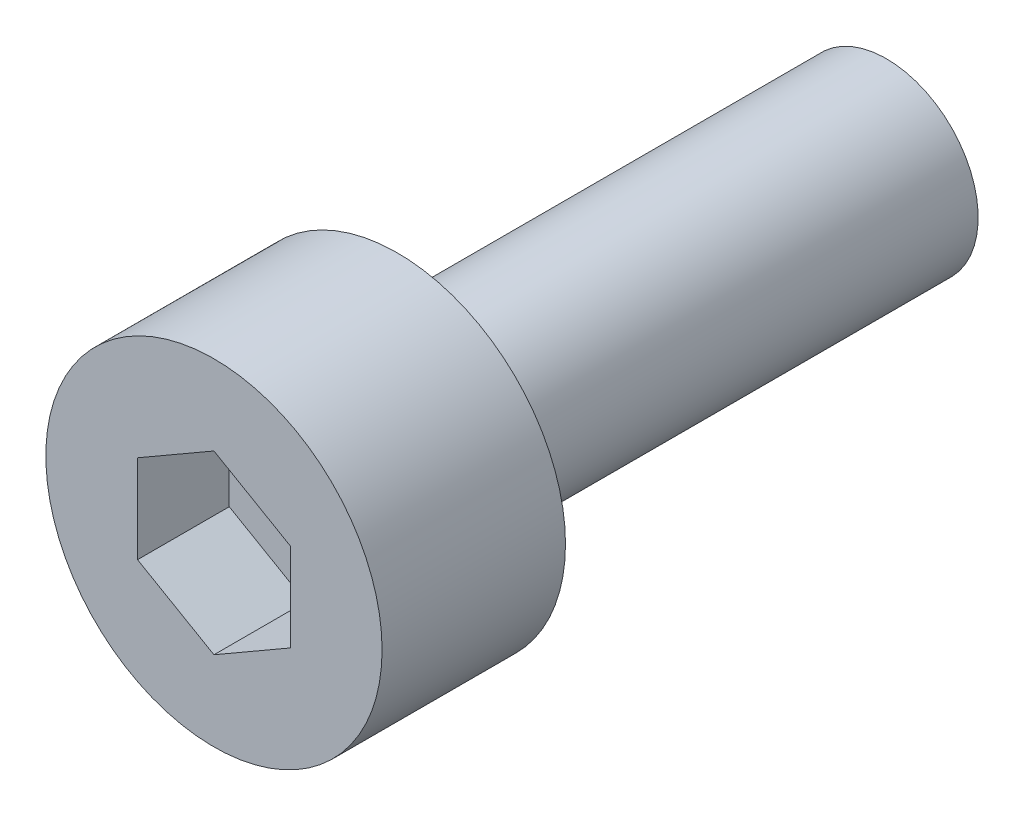
ISO-10303-21;
HEADER;
FILE_DESCRIPTION(('STEP AP214'),'2;1');
FILE_NAME('part.step','',(''),(''),'','','');
FILE_SCHEMA(('AUTOMOTIVE_DESIGN { 1 0 10303 214 1 1 1 1 }'));
ENDSEC;
DATA;
#1=APPLICATION_CONTEXT('core data for automotive mechanical design processes');
#2=APPLICATION_PROTOCOL_DEFINITION('international standard','automotive_design',2000,#1);
#3=PRODUCT_CONTEXT('',#1,'mechanical');
#4=PRODUCT('Part','Part','',(#3));
#5=PRODUCT_RELATED_PRODUCT_CATEGORY('part','',(#4));
#6=PRODUCT_DEFINITION_FORMATION('','',#4);
#7=PRODUCT_DEFINITION_CONTEXT('part definition',#1,'design');
#8=PRODUCT_DEFINITION('design','',#6,#7);
#9=PRODUCT_DEFINITION_SHAPE('','',#8);
#10=(LENGTH_UNIT() NAMED_UNIT(*) SI_UNIT(.MILLI.,.METRE.));
#11=(NAMED_UNIT(*) PLANE_ANGLE_UNIT() SI_UNIT($,.RADIAN.));
#12=(NAMED_UNIT(*) SI_UNIT($,.STERADIAN.) SOLID_ANGLE_UNIT());
#13=UNCERTAINTY_MEASURE_WITH_UNIT(LENGTH_MEASURE(1.E-05),#10,'distance_accuracy_value','');
#14=(GEOMETRIC_REPRESENTATION_CONTEXT(3) GLOBAL_UNCERTAINTY_ASSIGNED_CONTEXT((#13)) GLOBAL_UNIT_ASSIGNED_CONTEXT((#10,
#11,#12)) REPRESENTATION_CONTEXT('',''));
#15=CARTESIAN_POINT('',(0.,0.,0.));
#16=DIRECTION('',(0.,0.,1.));
#17=DIRECTION('',(1.,0.,0.));
#18=AXIS2_PLACEMENT_3D('',#15,#16,#17);
#19=CARTESIAN_POINT('',(0.,0.,3.));
#20=DIRECTION('',(0.,0.,-1.));
#21=DIRECTION('',(-1.,0.,0.));
#22=AXIS2_PLACEMENT_3D('',#19,#20,#21);
#23=CYLINDRICAL_SURFACE('',#22,2.75);
#24=CARTESIAN_POINT('',(0.,0.,3.));
#25=DIRECTION('',(0.,0.,1.));
#26=DIRECTION('',(1.,0.,0.));
#27=AXIS2_PLACEMENT_3D('',#24,#25,#26);
#28=CIRCLE('',#27,2.75);
#29=CARTESIAN_POINT('',(2.75,0.,3.));
#30=VERTEX_POINT('',#29);
#31=EDGE_CURVE('E51',#30,#30,#28,.T.);
#32=ORIENTED_EDGE('',*,*,#31,.F.);
#33=EDGE_LOOP('',(#32));
#34=FACE_BOUND('',#33,.T.);
#35=CARTESIAN_POINT('',(0.,0.,0.));
#36=DIRECTION('',(0.,0.,1.));
#37=DIRECTION('',(1.,0.,0.));
#38=AXIS2_PLACEMENT_3D('',#35,#36,#37);
#39=CIRCLE('',#38,2.75);
#40=CARTESIAN_POINT('',(2.75,0.,0.));
#41=VERTEX_POINT('',#40);
#42=EDGE_CURVE('E45',#41,#41,#39,.T.);
#43=ORIENTED_EDGE('',*,*,#42,.T.);
#44=EDGE_LOOP('',(#43));
#45=FACE_BOUND('',#44,.T.);
#46=ADVANCED_FACE('F42',(#34,#45),#23,.T.);
#47=CARTESIAN_POINT('',(0.,0.,3.));
#48=DIRECTION('',(0.,0.,1.));
#49=DIRECTION('',(1.,0.,0.));
#50=AXIS2_PLACEMENT_3D('',#47,#48,#49);
#51=PLANE('',#50);
#52=DIRECTION('',(0.866025403784439,-0.5,0.));
#53=VECTOR('',#52,1.);
#54=CARTESIAN_POINT('',(-1.25,-0.721687836487032,3.));
#55=LINE('',#54,#53);
#56=CARTESIAN_POINT('',(-1.25,-0.721687836487032,3.));
#57=VERTEX_POINT('',#56);
#58=CARTESIAN_POINT('',(0.,-1.44337567297406,3.));
#59=VERTEX_POINT('',#58);
#60=EDGE_CURVE('E59',#57,#59,#55,.T.);
#61=ORIENTED_EDGE('',*,*,#60,.F.);
#62=DIRECTION('',(0.,-1.,0.));
#63=VECTOR('',#62,1.);
#64=CARTESIAN_POINT('',(-1.25,0.721687836487032,3.));
#65=LINE('',#64,#63);
#66=CARTESIAN_POINT('',(-1.25,0.721687836487032,3.));
#67=VERTEX_POINT('',#66);
#68=EDGE_CURVE('E153',#67,#57,#65,.T.);
#69=ORIENTED_EDGE('',*,*,#68,.F.);
#70=DIRECTION('',(-0.866025403784438,-0.5,0.));
#71=VECTOR('',#70,1.);
#72=CARTESIAN_POINT('',(0.,1.44337567297407,3.));
#73=LINE('',#72,#71);
#74=CARTESIAN_POINT('',(0.,1.44337567297407,3.));
#75=VERTEX_POINT('',#74);
#76=EDGE_CURVE('E150',#75,#67,#73,.T.);
#77=ORIENTED_EDGE('',*,*,#76,.F.);
#78=DIRECTION('',(-0.866025403784439,0.5,0.));
#79=VECTOR('',#78,1.);
#80=CARTESIAN_POINT('',(1.25,0.721687836487033,3.));
#81=LINE('',#80,#79);
#82=CARTESIAN_POINT('',(1.25,0.721687836487033,3.));
#83=VERTEX_POINT('',#82);
#84=EDGE_CURVE('E107',#83,#75,#81,.T.);
#85=ORIENTED_EDGE('',*,*,#84,.F.);
#86=DIRECTION('',(0.,1.,0.));
#87=VECTOR('',#86,1.);
#88=CARTESIAN_POINT('',(1.25,-0.721687836487032,3.));
#89=LINE('',#88,#87);
#90=CARTESIAN_POINT('',(1.25,-0.721687836487032,3.));
#91=VERTEX_POINT('',#90);
#92=EDGE_CURVE('E144',#91,#83,#89,.T.);
#93=ORIENTED_EDGE('',*,*,#92,.F.);
#94=DIRECTION('',(0.866025403784439,0.5,0.));
#95=VECTOR('',#94,1.);
#96=CARTESIAN_POINT('',(0.,-1.44337567297406,3.));
#97=LINE('',#96,#95);
#98=EDGE_CURVE('E139',#59,#91,#97,.T.);
#99=ORIENTED_EDGE('',*,*,#98,.F.);
#100=EDGE_LOOP('',(#61,#69,#77,#85,#93,#99));
#101=FACE_BOUND('',#100,.T.);
#102=ORIENTED_EDGE('',*,*,#31,.T.);
#103=EDGE_LOOP('',(#102));
#104=FACE_BOUND('',#103,.T.);
#105=ADVANCED_FACE('F179',(#101,#104),#51,.T.);
#106=CARTESIAN_POINT('',(0.,0.,0.));
#107=DIRECTION('',(0.,0.,1.));
#108=DIRECTION('',(1.,0.,0.));
#109=AXIS2_PLACEMENT_3D('',#106,#107,#108);
#110=PLANE('',#109);
#111=CARTESIAN_POINT('',(0.,0.,0.));
#112=DIRECTION('',(0.,0.,-1.));
#113=DIRECTION('',(-1.,0.,0.));
#114=AXIS2_PLACEMENT_3D('',#111,#112,#113);
#115=CIRCLE('',#114,1.5);
#116=CARTESIAN_POINT('',(-1.5,0.,0.));
#117=VERTEX_POINT('',#116);
#118=EDGE_CURVE('E11',#117,#117,#115,.T.);
#119=ORIENTED_EDGE('',*,*,#118,.F.);
#120=EDGE_LOOP('',(#119));
#121=FACE_BOUND('',#120,.T.);
#122=ORIENTED_EDGE('',*,*,#42,.F.);
#123=EDGE_LOOP('',(#122));
#124=FACE_BOUND('',#123,.T.);
#125=ADVANCED_FACE('F176',(#121,#124),#110,.F.);
#126=CARTESIAN_POINT('',(-1.25,-0.721687836487032,1.5));
#127=DIRECTION('',(-0.5,-0.866025403784439,0.));
#128=DIRECTION('',(0.866025403784439,-0.5,0.));
#129=AXIS2_PLACEMENT_3D('',#126,#127,#128);
#130=PLANE('',#129);
#131=ORIENTED_EDGE('',*,*,#60,.T.);
#132=DIRECTION('',(0.,0.,1.));
#133=VECTOR('',#132,1.);
#134=CARTESIAN_POINT('',(0.,-1.44337567297406,1.5));
#135=LINE('',#134,#133);
#136=CARTESIAN_POINT('',(0.,-1.44337567297406,1.5));
#137=VERTEX_POINT('',#136);
#138=EDGE_CURVE('E89',#137,#59,#135,.T.);
#139=ORIENTED_EDGE('',*,*,#138,.F.);
#140=DIRECTION('',(0.866025403784439,-0.5,0.));
#141=VECTOR('',#140,1.);
#142=CARTESIAN_POINT('',(-1.25,-0.721687836487032,1.5));
#143=LINE('',#142,#141);
#144=CARTESIAN_POINT('',(-1.25,-0.721687836487032,1.5));
#145=VERTEX_POINT('',#144);
#146=EDGE_CURVE('E156',#145,#137,#143,.T.);
#147=ORIENTED_EDGE('',*,*,#146,.F.);
#148=DIRECTION('',(0.,0.,1.));
#149=VECTOR('',#148,1.);
#150=CARTESIAN_POINT('',(-1.25,-0.721687836487032,1.5));
#151=LINE('',#150,#149);
#152=EDGE_CURVE('E67',#145,#57,#151,.T.);
#153=ORIENTED_EDGE('',*,*,#152,.T.);
#154=EDGE_LOOP('',(#131,#139,#147,#153));
#155=FACE_BOUND('',#154,.T.);
#156=ADVANCED_FACE('F178',(#155),#130,.F.);
#157=CARTESIAN_POINT('',(-1.25,0.721687836487032,1.5));
#158=DIRECTION('',(-1.,0.,0.));
#159=DIRECTION('',(0.,0.,1.));
#160=AXIS2_PLACEMENT_3D('',#157,#158,#159);
#161=PLANE('',#160);
#162=ORIENTED_EDGE('',*,*,#68,.T.);
#163=ORIENTED_EDGE('',*,*,#152,.F.);
#164=DIRECTION('',(0.,-1.,0.));
#165=VECTOR('',#164,1.);
#166=CARTESIAN_POINT('',(-1.25,0.721687836487032,1.5));
#167=LINE('',#166,#165);
#168=CARTESIAN_POINT('',(-1.25,0.721687836487032,1.5));
#169=VERTEX_POINT('',#168);
#170=EDGE_CURVE('E121',#169,#145,#167,.T.);
#171=ORIENTED_EDGE('',*,*,#170,.F.);
#172=DIRECTION('',(0.,0.,1.));
#173=VECTOR('',#172,1.);
#174=CARTESIAN_POINT('',(-1.25,0.721687836487032,1.5));
#175=LINE('',#174,#173);
#176=EDGE_CURVE('E112',#169,#67,#175,.T.);
#177=ORIENTED_EDGE('',*,*,#176,.T.);
#178=EDGE_LOOP('',(#162,#163,#171,#177));
#179=FACE_BOUND('',#178,.T.);
#180=ADVANCED_FACE('F185',(#179),#161,.F.);
#181=CARTESIAN_POINT('',(0.,1.44337567297407,1.5));
#182=DIRECTION('',(-0.5,0.866025403784439,0.));
#183=DIRECTION('',(-0.866025403784439,-0.5,0.));
#184=AXIS2_PLACEMENT_3D('',#181,#182,#183);
#185=PLANE('',#184);
#186=ORIENTED_EDGE('',*,*,#76,.T.);
#187=ORIENTED_EDGE('',*,*,#176,.F.);
#188=DIRECTION('',(-0.866025403784438,-0.5,0.));
#189=VECTOR('',#188,1.);
#190=CARTESIAN_POINT('',(0.,1.44337567297407,1.5));
#191=LINE('',#190,#189);
#192=CARTESIAN_POINT('',(0.,1.44337567297407,1.5));
#193=VERTEX_POINT('',#192);
#194=EDGE_CURVE('E116',#193,#169,#191,.T.);
#195=ORIENTED_EDGE('',*,*,#194,.F.);
#196=DIRECTION('',(0.,0.,1.));
#197=VECTOR('',#196,1.);
#198=CARTESIAN_POINT('',(0.,1.44337567297407,1.5));
#199=LINE('',#198,#197);
#200=EDGE_CURVE('E100',#193,#75,#199,.T.);
#201=ORIENTED_EDGE('',*,*,#200,.T.);
#202=EDGE_LOOP('',(#186,#187,#195,#201));
#203=FACE_BOUND('',#202,.T.);
#204=ADVANCED_FACE('F117',(#203),#185,.F.);
#205=CARTESIAN_POINT('',(1.25,0.721687836487033,1.5));
#206=DIRECTION('',(0.5,0.866025403784439,0.));
#207=DIRECTION('',(-0.866025403784439,0.5,0.));
#208=AXIS2_PLACEMENT_3D('',#205,#206,#207);
#209=PLANE('',#208);
#210=ORIENTED_EDGE('',*,*,#84,.T.);
#211=ORIENTED_EDGE('',*,*,#200,.F.);
#212=DIRECTION('',(-0.866025403784439,0.5,0.));
#213=VECTOR('',#212,1.);
#214=CARTESIAN_POINT('',(1.25,0.721687836487033,1.5));
#215=LINE('',#214,#213);
#216=CARTESIAN_POINT('',(1.25,0.721687836487033,1.5));
#217=VERTEX_POINT('',#216);
#218=EDGE_CURVE('E104',#217,#193,#215,.T.);
#219=ORIENTED_EDGE('',*,*,#218,.F.);
#220=DIRECTION('',(0.,0.,1.));
#221=VECTOR('',#220,1.);
#222=CARTESIAN_POINT('',(1.25,0.721687836487033,1.5));
#223=LINE('',#222,#221);
#224=EDGE_CURVE('E113',#217,#83,#223,.T.);
#225=ORIENTED_EDGE('',*,*,#224,.T.);
#226=EDGE_LOOP('',(#210,#211,#219,#225));
#227=FACE_BOUND('',#226,.T.);
#228=ADVANCED_FACE('F102',(#227),#209,.F.);
#229=CARTESIAN_POINT('',(1.25,-0.721687836487032,1.5));
#230=DIRECTION('',(1.,0.,0.));
#231=DIRECTION('',(0.,1.,0.));
#232=AXIS2_PLACEMENT_3D('',#229,#230,#231);
#233=PLANE('',#232);
#234=ORIENTED_EDGE('',*,*,#92,.T.);
#235=ORIENTED_EDGE('',*,*,#224,.F.);
#236=DIRECTION('',(0.,1.,0.));
#237=VECTOR('',#236,1.);
#238=CARTESIAN_POINT('',(1.25,-0.721687836487032,1.5));
#239=LINE('',#238,#237);
#240=CARTESIAN_POINT('',(1.25,-0.721687836487032,1.5));
#241=VERTEX_POINT('',#240);
#242=EDGE_CURVE('E127',#241,#217,#239,.T.);
#243=ORIENTED_EDGE('',*,*,#242,.F.);
#244=DIRECTION('',(0.,0.,1.));
#245=VECTOR('',#244,1.);
#246=CARTESIAN_POINT('',(1.25,-0.721687836487032,1.5));
#247=LINE('',#246,#245);
#248=EDGE_CURVE('E163',#241,#91,#247,.T.);
#249=ORIENTED_EDGE('',*,*,#248,.T.);
#250=EDGE_LOOP('',(#234,#235,#243,#249));
#251=FACE_BOUND('',#250,.T.);
#252=ADVANCED_FACE('F234',(#251),#233,.F.);
#253=CARTESIAN_POINT('',(0.,-1.44337567297406,1.5));
#254=DIRECTION('',(0.5,-0.866025403784438,0.));
#255=DIRECTION('',(0.866025403784439,0.5,0.));
#256=AXIS2_PLACEMENT_3D('',#253,#254,#255);
#257=PLANE('',#256);
#258=ORIENTED_EDGE('',*,*,#98,.T.);
#259=ORIENTED_EDGE('',*,*,#248,.F.);
#260=DIRECTION('',(0.866025403784439,0.5,0.));
#261=VECTOR('',#260,1.);
#262=CARTESIAN_POINT('',(0.,-1.44337567297406,1.5));
#263=LINE('',#262,#261);
#264=EDGE_CURVE('E131',#137,#241,#263,.T.);
#265=ORIENTED_EDGE('',*,*,#264,.F.);
#266=ORIENTED_EDGE('',*,*,#138,.T.);
#267=EDGE_LOOP('',(#258,#259,#265,#266));
#268=FACE_BOUND('',#267,.T.);
#269=ADVANCED_FACE('F244',(#268),#257,.F.);
#270=CARTESIAN_POINT('',(0.,0.,1.5));
#271=DIRECTION('',(0.,0.,1.));
#272=DIRECTION('',(1.,0.,0.));
#273=AXIS2_PLACEMENT_3D('',#270,#271,#272);
#274=PLANE('',#273);
#275=ORIENTED_EDGE('',*,*,#146,.T.);
#276=ORIENTED_EDGE('',*,*,#264,.T.);
#277=ORIENTED_EDGE('',*,*,#242,.T.);
#278=ORIENTED_EDGE('',*,*,#218,.T.);
#279=ORIENTED_EDGE('',*,*,#194,.T.);
#280=ORIENTED_EDGE('',*,*,#170,.T.);
#281=EDGE_LOOP('',(#275,#276,#277,#278,#279,#280));
#282=FACE_BOUND('',#281,.T.);
#283=ADVANCED_FACE('F124',(#282),#274,.T.);
#284=CARTESIAN_POINT('',(0.,0.,-8.));
#285=DIRECTION('',(0.,0.,1.));
#286=DIRECTION('',(1.,0.,0.));
#287=AXIS2_PLACEMENT_3D('',#284,#285,#286);
#288=CYLINDRICAL_SURFACE('',#287,1.5);
#289=CARTESIAN_POINT('',(0.,0.,-8.));
#290=DIRECTION('',(0.,0.,-1.));
#291=DIRECTION('',(-1.,0.,0.));
#292=AXIS2_PLACEMENT_3D('',#289,#290,#291);
#293=CIRCLE('',#292,1.5);
#294=CARTESIAN_POINT('',(-1.5,0.,-8.));
#295=VERTEX_POINT('',#294);
#296=EDGE_CURVE('E140',#295,#295,#293,.T.);
#297=ORIENTED_EDGE('',*,*,#296,.F.);
#298=EDGE_LOOP('',(#297));
#299=FACE_BOUND('',#298,.T.);
#300=ORIENTED_EDGE('',*,*,#118,.T.);
#301=EDGE_LOOP('',(#300));
#302=FACE_BOUND('',#301,.T.);
#303=ADVANCED_FACE('F264',(#299,#302),#288,.T.);
#304=CARTESIAN_POINT('',(0.,0.,-8.));
#305=DIRECTION('',(0.,0.,-1.));
#306=DIRECTION('',(-1.,0.,0.));
#307=AXIS2_PLACEMENT_3D('',#304,#305,#306);
#308=PLANE('',#307);
#309=ORIENTED_EDGE('',*,*,#296,.T.);
#310=EDGE_LOOP('',(#309));
#311=FACE_BOUND('',#310,.T.);
#312=ADVANCED_FACE('F279',(#311),#308,.T.);
#313=CLOSED_SHELL('',(#46,#105,#125,#156,#180,#204,#228,#252,#269,#283,#303,#312));
#314=MANIFOLD_SOLID_BREP('B2',#313);
#315=ADVANCED_BREP_SHAPE_REPRESENTATION('',(#18,#314),#14);
#316=SHAPE_DEFINITION_REPRESENTATION(#9,#315);
ENDSEC;
END-ISO-10303-21;
